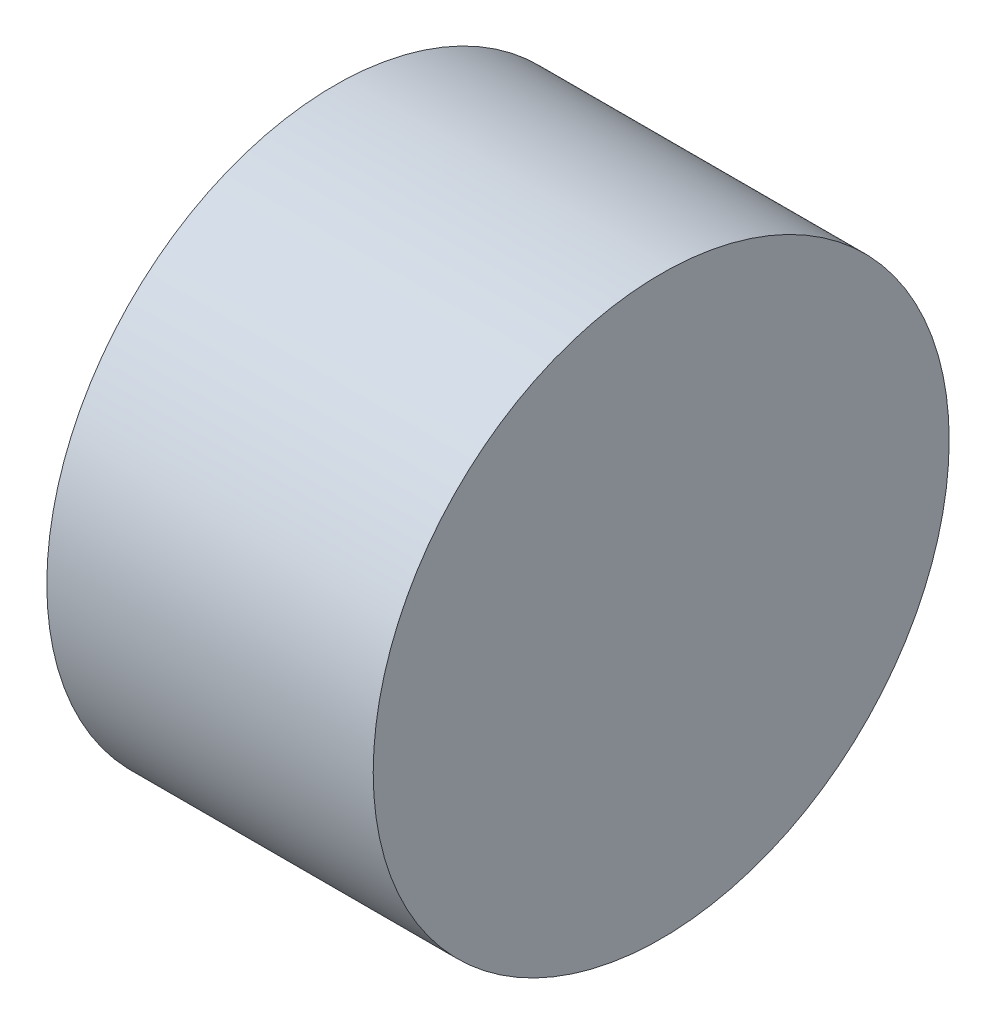
ISO-10303-21;
HEADER;
FILE_DESCRIPTION(('STEP AP214'),'2;1');
FILE_NAME('part.step','',(''),(''),'','','');
FILE_SCHEMA(('AUTOMOTIVE_DESIGN { 1 0 10303 214 1 1 1 1 }'));
ENDSEC;
DATA;
#1=APPLICATION_CONTEXT('core data for automotive mechanical design processes');
#2=APPLICATION_PROTOCOL_DEFINITION('international standard','automotive_design',2000,#1);
#3=PRODUCT_CONTEXT('',#1,'mechanical');
#4=PRODUCT('Part','Part','',(#3));
#5=PRODUCT_RELATED_PRODUCT_CATEGORY('part','',(#4));
#6=PRODUCT_DEFINITION_FORMATION('','',#4);
#7=PRODUCT_DEFINITION_CONTEXT('part definition',#1,'design');
#8=PRODUCT_DEFINITION('design','',#6,#7);
#9=PRODUCT_DEFINITION_SHAPE('','',#8);
#10=(LENGTH_UNIT() NAMED_UNIT(*) SI_UNIT(.MILLI.,.METRE.));
#11=(NAMED_UNIT(*) PLANE_ANGLE_UNIT() SI_UNIT($,.RADIAN.));
#12=(NAMED_UNIT(*) SI_UNIT($,.STERADIAN.) SOLID_ANGLE_UNIT());
#13=UNCERTAINTY_MEASURE_WITH_UNIT(LENGTH_MEASURE(1.E-05),#10,'distance_accuracy_value','');
#14=(GEOMETRIC_REPRESENTATION_CONTEXT(3) GLOBAL_UNCERTAINTY_ASSIGNED_CONTEXT((#13)) GLOBAL_UNIT_ASSIGNED_CONTEXT((#10,
#11,#12)) REPRESENTATION_CONTEXT('',''));
#15=CARTESIAN_POINT('',(0.,0.,0.));
#16=DIRECTION('',(0.,0.,1.));
#17=DIRECTION('',(1.,0.,0.));
#18=AXIS2_PLACEMENT_3D('',#15,#16,#17);
#19=CARTESIAN_POINT('',(3.4,0.,0.));
#20=DIRECTION('',(-1.,0.,0.));
#21=DIRECTION('',(0.,0.,1.));
#22=AXIS2_PLACEMENT_3D('',#19,#20,#21);
#23=CYLINDRICAL_SURFACE('',#22,3.);
#24=CARTESIAN_POINT('',(3.4,0.,0.));
#25=DIRECTION('',(1.,0.,0.));
#26=DIRECTION('',(0.,0.,-1.));
#27=AXIS2_PLACEMENT_3D('',#24,#25,#26);
#28=CIRCLE('',#27,3.);
#29=CARTESIAN_POINT('',(3.4,0.,-3.));
#30=VERTEX_POINT('',#29);
#31=EDGE_CURVE('E10',#30,#30,#28,.T.);
#32=ORIENTED_EDGE('',*,*,#31,.F.);
#33=EDGE_LOOP('',(#32));
#34=FACE_BOUND('',#33,.T.);
#35=CARTESIAN_POINT('',(0.,0.,0.));
#36=DIRECTION('',(1.,0.,0.));
#37=DIRECTION('',(0.,0.,-1.));
#38=AXIS2_PLACEMENT_3D('',#35,#36,#37);
#39=CIRCLE('',#38,3.);
#40=CARTESIAN_POINT('',(0.,0.,-3.));
#41=VERTEX_POINT('',#40);
#42=EDGE_CURVE('E35',#41,#41,#39,.T.);
#43=ORIENTED_EDGE('',*,*,#42,.T.);
#44=EDGE_LOOP('',(#43));
#45=FACE_BOUND('',#44,.T.);
#46=ADVANCED_FACE('F32',(#34,#45),#23,.T.);
#47=CARTESIAN_POINT('',(3.4,0.,0.));
#48=DIRECTION('',(1.,0.,0.));
#49=DIRECTION('',(0.,0.,-1.));
#50=AXIS2_PLACEMENT_3D('',#47,#48,#49);
#51=PLANE('',#50);
#52=ORIENTED_EDGE('',*,*,#31,.T.);
#53=EDGE_LOOP('',(#52));
#54=FACE_BOUND('',#53,.T.);
#55=ADVANCED_FACE('F47',(#54),#51,.T.);
#56=CARTESIAN_POINT('',(0.,0.,0.));
#57=DIRECTION('',(1.,0.,0.));
#58=DIRECTION('',(0.,0.,-1.));
#59=AXIS2_PLACEMENT_3D('',#56,#57,#58);
#60=PLANE('',#59);
#61=ORIENTED_EDGE('',*,*,#42,.F.);
#62=EDGE_LOOP('',(#61));
#63=FACE_BOUND('',#62,.T.);
#64=ADVANCED_FACE('F45',(#63),#60,.F.);
#65=CLOSED_SHELL('',(#46,#55,#64));
#66=MANIFOLD_SOLID_BREP('B2',#65);
#67=ADVANCED_BREP_SHAPE_REPRESENTATION('',(#18,#66),#14);
#68=SHAPE_DEFINITION_REPRESENTATION(#9,#67);
ENDSEC;
END-ISO-10303-21;
